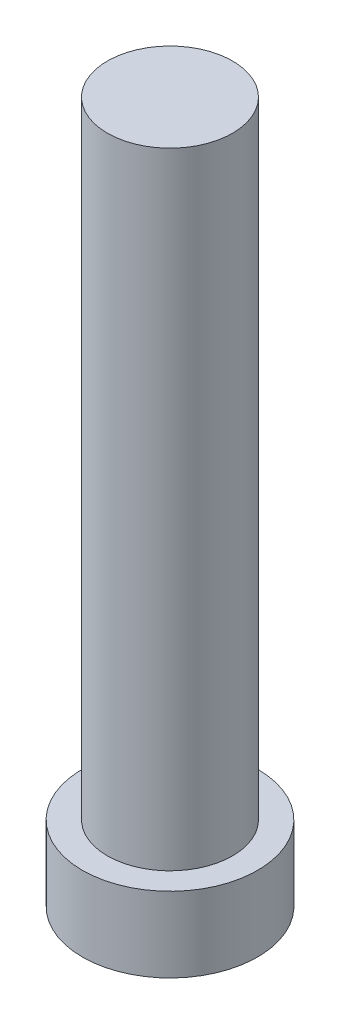
ISO-10303-21;
HEADER;
FILE_DESCRIPTION(('STEP AP214'),'2;1');
FILE_NAME('part.step','',(''),(''),'','','');
FILE_SCHEMA(('AUTOMOTIVE_DESIGN { 1 0 10303 214 1 1 1 1 }'));
ENDSEC;
DATA;
#1=APPLICATION_CONTEXT('core data for automotive mechanical design processes');
#2=APPLICATION_PROTOCOL_DEFINITION('international standard','automotive_design',2000,#1);
#3=PRODUCT_CONTEXT('',#1,'mechanical');
#4=PRODUCT('Part','Part','',(#3));
#5=PRODUCT_RELATED_PRODUCT_CATEGORY('part','',(#4));
#6=PRODUCT_DEFINITION_FORMATION('','',#4);
#7=PRODUCT_DEFINITION_CONTEXT('part definition',#1,'design');
#8=PRODUCT_DEFINITION('design','',#6,#7);
#9=PRODUCT_DEFINITION_SHAPE('','',#8);
#10=(LENGTH_UNIT() NAMED_UNIT(*) SI_UNIT(.MILLI.,.METRE.));
#11=(NAMED_UNIT(*) PLANE_ANGLE_UNIT() SI_UNIT($,.RADIAN.));
#12=(NAMED_UNIT(*) SI_UNIT($,.STERADIAN.) SOLID_ANGLE_UNIT());
#13=UNCERTAINTY_MEASURE_WITH_UNIT(LENGTH_MEASURE(1.E-05),#10,'distance_accuracy_value','');
#14=(GEOMETRIC_REPRESENTATION_CONTEXT(3) GLOBAL_UNCERTAINTY_ASSIGNED_CONTEXT((#13)) GLOBAL_UNIT_ASSIGNED_CONTEXT((#10,
#11,#12)) REPRESENTATION_CONTEXT('',''));
#15=CARTESIAN_POINT('',(0.,0.,0.));
#16=DIRECTION('',(0.,0.,1.));
#17=DIRECTION('',(1.,0.,0.));
#18=AXIS2_PLACEMENT_3D('',#15,#16,#17);
#19=CARTESIAN_POINT('',(0.,3.,0.));
#20=DIRECTION('',(0.,-1.,0.));
#21=DIRECTION('',(0.,0.,-1.));
#22=AXIS2_PLACEMENT_3D('',#19,#20,#21);
#23=CYLINDRICAL_SURFACE('',#22,3.5);
#24=CARTESIAN_POINT('',(0.,3.,0.));
#25=DIRECTION('',(0.,1.,0.));
#26=DIRECTION('',(0.,0.,1.));
#27=AXIS2_PLACEMENT_3D('',#24,#25,#26);
#28=CIRCLE('',#27,3.5);
#29=CARTESIAN_POINT('',(0.,3.,3.5));
#30=VERTEX_POINT('',#29);
#31=EDGE_CURVE('E49',#30,#30,#28,.T.);
#32=ORIENTED_EDGE('',*,*,#31,.F.);
#33=EDGE_LOOP('',(#32));
#34=FACE_BOUND('',#33,.T.);
#35=CARTESIAN_POINT('',(0.,0.,0.));
#36=DIRECTION('',(0.,1.,0.));
#37=DIRECTION('',(0.,0.,1.));
#38=AXIS2_PLACEMENT_3D('',#35,#36,#37);
#39=CIRCLE('',#38,3.5);
#40=CARTESIAN_POINT('',(0.,0.,3.5));
#41=VERTEX_POINT('',#40);
#42=EDGE_CURVE('E44',#41,#41,#39,.T.);
#43=ORIENTED_EDGE('',*,*,#42,.T.);
#44=EDGE_LOOP('',(#43));
#45=FACE_BOUND('',#44,.T.);
#46=ADVANCED_FACE('F41',(#34,#45),#23,.T.);
#47=CARTESIAN_POINT('',(0.,3.,0.));
#48=DIRECTION('',(0.,1.,0.));
#49=DIRECTION('',(0.,0.,1.));
#50=AXIS2_PLACEMENT_3D('',#47,#48,#49);
#51=PLANE('',#50);
#52=CARTESIAN_POINT('',(0.,3.,0.));
#53=DIRECTION('',(0.,1.,0.));
#54=DIRECTION('',(0.,0.,1.));
#55=AXIS2_PLACEMENT_3D('',#52,#53,#54);
#56=CIRCLE('',#55,2.5);
#57=CARTESIAN_POINT('',(0.,3.,2.5));
#58=VERTEX_POINT('',#57);
#59=EDGE_CURVE('E10',#58,#58,#56,.T.);
#60=ORIENTED_EDGE('',*,*,#59,.F.);
#61=EDGE_LOOP('',(#60));
#62=FACE_BOUND('',#61,.T.);
#63=ORIENTED_EDGE('',*,*,#31,.T.);
#64=EDGE_LOOP('',(#63));
#65=FACE_BOUND('',#64,.T.);
#66=ADVANCED_FACE('F69',(#62,#65),#51,.T.);
#67=CARTESIAN_POINT('',(0.,0.,0.));
#68=DIRECTION('',(0.,1.,0.));
#69=DIRECTION('',(0.,0.,1.));
#70=AXIS2_PLACEMENT_3D('',#67,#68,#69);
#71=PLANE('',#70);
#72=ORIENTED_EDGE('',*,*,#42,.F.);
#73=EDGE_LOOP('',(#72));
#74=FACE_BOUND('',#73,.T.);
#75=ADVANCED_FACE('F66',(#74),#71,.F.);
#76=CARTESIAN_POINT('',(0.,28.,0.));
#77=DIRECTION('',(0.,-1.,0.));
#78=DIRECTION('',(0.,0.,-1.));
#79=AXIS2_PLACEMENT_3D('',#76,#77,#78);
#80=CYLINDRICAL_SURFACE('',#79,2.5);
#81=CARTESIAN_POINT('',(0.,28.,0.));
#82=DIRECTION('',(0.,1.,0.));
#83=DIRECTION('',(0.,0.,1.));
#84=AXIS2_PLACEMENT_3D('',#81,#82,#83);
#85=CIRCLE('',#84,2.5);
#86=CARTESIAN_POINT('',(0.,28.,2.5));
#87=VERTEX_POINT('',#86);
#88=EDGE_CURVE('E56',#87,#87,#85,.T.);
#89=ORIENTED_EDGE('',*,*,#88,.F.);
#90=EDGE_LOOP('',(#89));
#91=FACE_BOUND('',#90,.T.);
#92=ORIENTED_EDGE('',*,*,#59,.T.);
#93=EDGE_LOOP('',(#92));
#94=FACE_BOUND('',#93,.T.);
#95=ADVANCED_FACE('F68',(#91,#94),#80,.T.);
#96=CARTESIAN_POINT('',(0.,28.,0.));
#97=DIRECTION('',(0.,1.,0.));
#98=DIRECTION('',(0.,0.,1.));
#99=AXIS2_PLACEMENT_3D('',#96,#97,#98);
#100=PLANE('',#99);
#101=ORIENTED_EDGE('',*,*,#88,.T.);
#102=EDGE_LOOP('',(#101));
#103=FACE_BOUND('',#102,.T.);
#104=ADVANCED_FACE('F74',(#103),#100,.T.);
#105=CLOSED_SHELL('',(#46,#66,#75,#95,#104));
#106=MANIFOLD_SOLID_BREP('B2',#105);
#107=ADVANCED_BREP_SHAPE_REPRESENTATION('',(#18,#106),#14);
#108=SHAPE_DEFINITION_REPRESENTATION(#9,#107);
ENDSEC;
END-ISO-10303-21;
